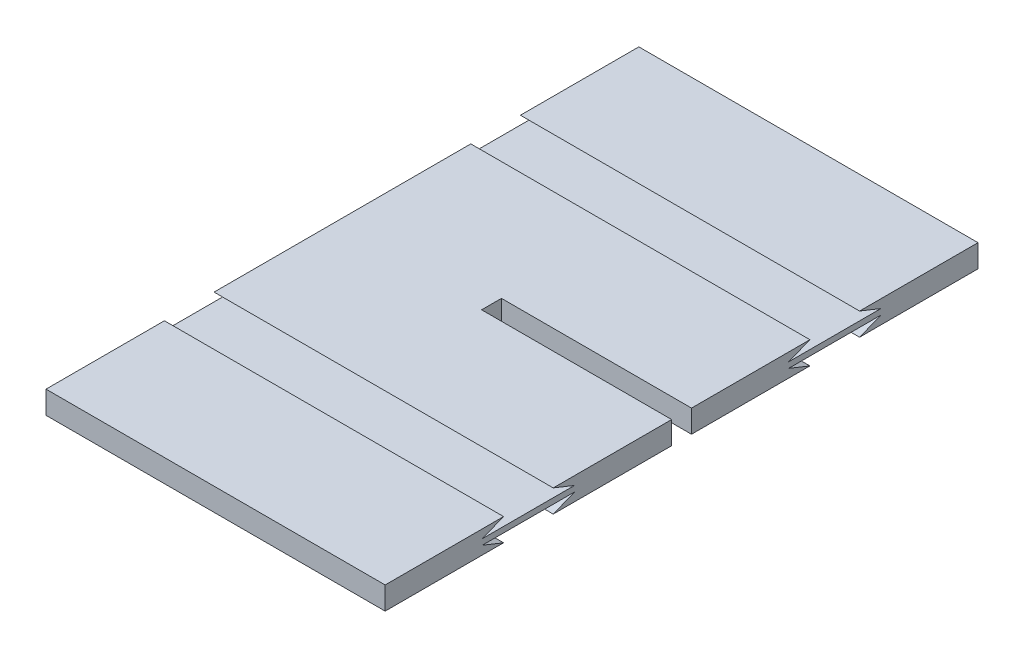
ISO-10303-21;
HEADER;
FILE_DESCRIPTION(('STEP AP214'),'2;1');
FILE_NAME('part.step','',(''),(''),'','','');
FILE_SCHEMA(('AUTOMOTIVE_DESIGN { 1 0 10303 214 1 1 1 1 }'));
ENDSEC;
DATA;
#1=APPLICATION_CONTEXT('core data for automotive mechanical design processes');
#2=APPLICATION_PROTOCOL_DEFINITION('international standard','automotive_design',2000,#1);
#3=PRODUCT_CONTEXT('',#1,'mechanical');
#4=PRODUCT('Part','Part','',(#3));
#5=PRODUCT_RELATED_PRODUCT_CATEGORY('part','',(#4));
#6=PRODUCT_DEFINITION_FORMATION('','',#4);
#7=PRODUCT_DEFINITION_CONTEXT('part definition',#1,'design');
#8=PRODUCT_DEFINITION('design','',#6,#7);
#9=PRODUCT_DEFINITION_SHAPE('','',#8);
#10=(LENGTH_UNIT() NAMED_UNIT(*) SI_UNIT(.MILLI.,.METRE.));
#11=(NAMED_UNIT(*) PLANE_ANGLE_UNIT() SI_UNIT($,.RADIAN.));
#12=(NAMED_UNIT(*) SI_UNIT($,.STERADIAN.) SOLID_ANGLE_UNIT());
#13=UNCERTAINTY_MEASURE_WITH_UNIT(LENGTH_MEASURE(1.E-05),#10,'distance_accuracy_value','');
#14=(GEOMETRIC_REPRESENTATION_CONTEXT(3) GLOBAL_UNCERTAINTY_ASSIGNED_CONTEXT((#13)) GLOBAL_UNIT_ASSIGNED_CONTEXT((#10,
#11,#12)) REPRESENTATION_CONTEXT('',''));
#15=CARTESIAN_POINT('',(0.,0.,0.));
#16=DIRECTION('',(0.,0.,1.));
#17=DIRECTION('',(1.,0.,0.));
#18=AXIS2_PLACEMENT_3D('',#15,#16,#17);
#19=CARTESIAN_POINT('',(0.,0.8,0.));
#20=DIRECTION('',(0.,1.,0.));
#21=DIRECTION('',(0.,0.,1.));
#22=AXIS2_PLACEMENT_3D('',#19,#20,#21);
#23=PLANE('',#22);
#24=DIRECTION('',(0.,0.,1.));
#25=VECTOR('',#24,1.);
#26=CARTESIAN_POINT('',(-1.52175925925925,0.8,10.45));
#27=LINE('',#26,#25);
#28=CARTESIAN_POINT('',(-1.52175925925925,0.8,-10.45));
#29=VERTEX_POINT('',#28);
#30=CARTESIAN_POINT('',(-1.52175925925925,0.8,-6.27500000000001));
#31=VERTEX_POINT('',#30);
#32=EDGE_CURVE('E57',#29,#31,#27,.T.);
#33=ORIENTED_EDGE('',*,*,#32,.F.);
#34=DIRECTION('',(1.,0.,0.));
#35=VECTOR('',#34,1.);
#36=CARTESIAN_POINT('',(0.,0.8,-10.45));
#37=LINE('',#36,#35);
#38=CARTESIAN_POINT('',(-13.4782407407407,0.8,-10.45));
#39=VERTEX_POINT('',#38);
#40=EDGE_CURVE('E211',#39,#29,#37,.T.);
#41=ORIENTED_EDGE('',*,*,#40,.F.);
#42=DIRECTION('',(0.,0.,-1.));
#43=VECTOR('',#42,1.);
#44=CARTESIAN_POINT('',(-13.4782407407407,0.8,0.));
#45=LINE('',#44,#43);
#46=CARTESIAN_POINT('',(-13.4782407407407,0.800000000000006,-6.275));
#47=VERTEX_POINT('',#46);
#48=EDGE_CURVE('E309',#47,#39,#45,.T.);
#49=ORIENTED_EDGE('',*,*,#48,.F.);
#50=DIRECTION('',(-1.,0.,0.));
#51=VECTOR('',#50,1.);
#52=CARTESIAN_POINT('',(0.,0.8,-6.27500000000001));
#53=LINE('',#52,#51);
#54=EDGE_CURVE('E258',#31,#47,#53,.T.);
#55=ORIENTED_EDGE('',*,*,#54,.F.);
#56=EDGE_LOOP('',(#33,#41,#49,#55));
#57=FACE_BOUND('',#56,.T.);
#58=ADVANCED_FACE('F34',(#57),#23,.T.);
#59=CARTESIAN_POINT('',(-1.52175925925925,0.8,-4.525));
#60=VERTEX_POINT('',#59);
#61=CARTESIAN_POINT('',(-1.52175925925925,0.8,-0.35));
#62=VERTEX_POINT('',#61);
#63=EDGE_CURVE('E433',#60,#62,#27,.T.);
#64=ORIENTED_EDGE('',*,*,#63,.F.);
#65=DIRECTION('',(1.,0.,0.));
#66=VECTOR('',#65,1.);
#67=CARTESIAN_POINT('',(0.,0.8,-4.525));
#68=LINE('',#67,#66);
#69=CARTESIAN_POINT('',(-13.4782407407407,0.8,-4.525));
#70=VERTEX_POINT('',#69);
#71=EDGE_CURVE('E260',#70,#60,#68,.T.);
#72=ORIENTED_EDGE('',*,*,#71,.F.);
#73=CARTESIAN_POINT('',(-13.4782407407407,0.8,4.525));
#74=VERTEX_POINT('',#73);
#75=EDGE_CURVE('E293',#74,#70,#45,.T.);
#76=ORIENTED_EDGE('',*,*,#75,.F.);
#77=DIRECTION('',(-1.,0.,0.));
#78=VECTOR('',#77,1.);
#79=CARTESIAN_POINT('',(0.,0.8,4.525));
#80=LINE('',#79,#78);
#81=CARTESIAN_POINT('',(-1.52175925925925,0.8,4.525));
#82=VERTEX_POINT('',#81);
#83=EDGE_CURVE('E253',#82,#74,#80,.T.);
#84=ORIENTED_EDGE('',*,*,#83,.F.);
#85=CARTESIAN_POINT('',(-1.52175925925925,0.8,0.35));
#86=VERTEX_POINT('',#85);
#87=EDGE_CURVE('E434',#86,#82,#27,.T.);
#88=ORIENTED_EDGE('',*,*,#87,.F.);
#89=DIRECTION('',(-1.,0.,0.));
#90=VECTOR('',#89,1.);
#91=CARTESIAN_POINT('',(0.,0.8,0.349999999999999));
#92=LINE('',#91,#90);
#93=CARTESIAN_POINT('',(-8.22175925925925,0.8,0.35));
#94=VERTEX_POINT('',#93);
#95=EDGE_CURVE('E231',#86,#94,#92,.T.);
#96=ORIENTED_EDGE('',*,*,#95,.T.);
#97=DIRECTION('',(0.,0.,-1.));
#98=VECTOR('',#97,1.);
#99=CARTESIAN_POINT('',(-8.22175925925925,0.8,0.));
#100=LINE('',#99,#98);
#101=CARTESIAN_POINT('',(-8.22175925925925,0.8,-0.35));
#102=VERTEX_POINT('',#101);
#103=EDGE_CURVE('E303',#94,#102,#100,.T.);
#104=ORIENTED_EDGE('',*,*,#103,.T.);
#105=DIRECTION('',(-1.,0.,0.));
#106=VECTOR('',#105,1.);
#107=CARTESIAN_POINT('',(0.,0.8,-0.349999999999999));
#108=LINE('',#107,#106);
#109=EDGE_CURVE('E306',#62,#102,#108,.T.);
#110=ORIENTED_EDGE('',*,*,#109,.F.);
#111=EDGE_LOOP('',(#64,#72,#76,#84,#88,#96,#104,#110));
#112=FACE_BOUND('',#111,.T.);
#113=ADVANCED_FACE('F334',(#112),#23,.T.);
#114=CARTESIAN_POINT('',(0.,0.,0.));
#115=DIRECTION('',(0.,1.,0.));
#116=DIRECTION('',(0.,0.,1.));
#117=AXIS2_PLACEMENT_3D('',#114,#115,#116);
#118=PLANE('',#117);
#119=DIRECTION('',(1.,0.,0.));
#120=VECTOR('',#119,1.);
#121=CARTESIAN_POINT('',(0.,0.,-10.45));
#122=LINE('',#121,#120);
#123=CARTESIAN_POINT('',(-13.4782407407407,0.,-10.45));
#124=VERTEX_POINT('',#123);
#125=CARTESIAN_POINT('',(-1.52175925925925,0.,-10.45));
#126=VERTEX_POINT('',#125);
#127=EDGE_CURVE('E209',#124,#126,#122,.T.);
#128=ORIENTED_EDGE('',*,*,#127,.T.);
#129=DIRECTION('',(0.,0.,1.));
#130=VECTOR('',#129,1.);
#131=CARTESIAN_POINT('',(-1.52175925925925,0.,10.45));
#132=LINE('',#131,#130);
#133=CARTESIAN_POINT('',(-1.52175925925925,0.,-6.275));
#134=VERTEX_POINT('',#133);
#135=EDGE_CURVE('E192',#126,#134,#132,.T.);
#136=ORIENTED_EDGE('',*,*,#135,.T.);
#137=DIRECTION('',(-1.,0.,0.));
#138=VECTOR('',#137,1.);
#139=CARTESIAN_POINT('',(0.,0.,-6.27500000000001));
#140=LINE('',#139,#138);
#141=CARTESIAN_POINT('',(-13.4782407407407,0.,-6.275));
#142=VERTEX_POINT('',#141);
#143=EDGE_CURVE('E251',#134,#142,#140,.T.);
#144=ORIENTED_EDGE('',*,*,#143,.T.);
#145=DIRECTION('',(0.,0.,-1.));
#146=VECTOR('',#145,1.);
#147=CARTESIAN_POINT('',(-13.4782407407407,0.,0.));
#148=LINE('',#147,#146);
#149=EDGE_CURVE('E216',#142,#124,#148,.T.);
#150=ORIENTED_EDGE('',*,*,#149,.T.);
#151=EDGE_LOOP('',(#128,#136,#144,#150));
#152=FACE_BOUND('',#151,.T.);
#153=ADVANCED_FACE('F214',(#152),#118,.F.);
#154=DIRECTION('',(1.,0.,0.));
#155=VECTOR('',#154,1.);
#156=CARTESIAN_POINT('',(0.,0.,-4.525));
#157=LINE('',#156,#155);
#158=CARTESIAN_POINT('',(-13.4782407407407,0.,-4.525));
#159=VERTEX_POINT('',#158);
#160=CARTESIAN_POINT('',(-1.52175925925925,0.,-4.52500000000002));
#161=VERTEX_POINT('',#160);
#162=EDGE_CURVE('E248',#159,#161,#157,.T.);
#163=ORIENTED_EDGE('',*,*,#162,.T.);
#164=CARTESIAN_POINT('',(-1.52175925925925,0.,-0.35));
#165=VERTEX_POINT('',#164);
#166=EDGE_CURVE('E201',#161,#165,#132,.T.);
#167=ORIENTED_EDGE('',*,*,#166,.T.);
#168=DIRECTION('',(-1.,0.,0.));
#169=VECTOR('',#168,1.);
#170=CARTESIAN_POINT('',(0.,0.,-0.349999999999999));
#171=LINE('',#170,#169);
#172=CARTESIAN_POINT('',(-8.22175925925925,0.,-0.35));
#173=VERTEX_POINT('',#172);
#174=EDGE_CURVE('E218',#165,#173,#171,.T.);
#175=ORIENTED_EDGE('',*,*,#174,.T.);
#176=DIRECTION('',(0.,0.,-1.));
#177=VECTOR('',#176,1.);
#178=CARTESIAN_POINT('',(-8.22175925925925,0.,0.));
#179=LINE('',#178,#177);
#180=CARTESIAN_POINT('',(-8.22175925925925,0.,0.35));
#181=VERTEX_POINT('',#180);
#182=EDGE_CURVE('E223',#181,#173,#179,.T.);
#183=ORIENTED_EDGE('',*,*,#182,.F.);
#184=DIRECTION('',(-1.,0.,0.));
#185=VECTOR('',#184,1.);
#186=CARTESIAN_POINT('',(0.,0.,0.349999999999999));
#187=LINE('',#186,#185);
#188=CARTESIAN_POINT('',(-1.52175925925925,0.,0.35));
#189=VERTEX_POINT('',#188);
#190=EDGE_CURVE('E294',#189,#181,#187,.T.);
#191=ORIENTED_EDGE('',*,*,#190,.F.);
#192=CARTESIAN_POINT('',(-1.52175925925925,0.,4.52500000000002));
#193=VERTEX_POINT('',#192);
#194=EDGE_CURVE('E431',#189,#193,#132,.T.);
#195=ORIENTED_EDGE('',*,*,#194,.T.);
#196=DIRECTION('',(-1.,0.,0.));
#197=VECTOR('',#196,1.);
#198=CARTESIAN_POINT('',(0.,0.,4.525));
#199=LINE('',#198,#197);
#200=CARTESIAN_POINT('',(-13.4782407407407,0.,4.525));
#201=VERTEX_POINT('',#200);
#202=EDGE_CURVE('E246',#193,#201,#199,.T.);
#203=ORIENTED_EDGE('',*,*,#202,.T.);
#204=EDGE_CURVE('E220',#201,#159,#148,.T.);
#205=ORIENTED_EDGE('',*,*,#204,.T.);
#206=EDGE_LOOP('',(#163,#167,#175,#183,#191,#195,#203,#205));
#207=FACE_BOUND('',#206,.T.);
#208=ADVANCED_FACE('F323',(#207),#118,.F.);
#209=CARTESIAN_POINT('',(0.,0.8,0.349999999999999));
#210=DIRECTION('',(0.,0.,1.));
#211=DIRECTION('',(1.,0.,0.));
#212=AXIS2_PLACEMENT_3D('',#209,#210,#211);
#213=PLANE('',#212);
#214=ORIENTED_EDGE('',*,*,#95,.F.);
#215=DIRECTION('',(0.,-1.,0.));
#216=VECTOR('',#215,1.);
#217=CARTESIAN_POINT('',(-1.52175925925925,0.8,0.349999999999999));
#218=LINE('',#217,#216);
#219=EDGE_CURVE('E339',#86,#189,#218,.T.);
#220=ORIENTED_EDGE('',*,*,#219,.T.);
#221=ORIENTED_EDGE('',*,*,#190,.T.);
#222=DIRECTION('',(0.,-1.,0.));
#223=VECTOR('',#222,1.);
#224=CARTESIAN_POINT('',(-8.22175925925925,0.8,0.35));
#225=LINE('',#224,#223);
#226=EDGE_CURVE('E240',#94,#181,#225,.T.);
#227=ORIENTED_EDGE('',*,*,#226,.F.);
#228=EDGE_LOOP('',(#214,#220,#221,#227));
#229=FACE_BOUND('',#228,.T.);
#230=ADVANCED_FACE('F36',(#229),#213,.F.);
#231=CARTESIAN_POINT('',(-8.22175925925925,0.8,0.));
#232=DIRECTION('',(-1.,0.,0.));
#233=DIRECTION('',(0.,0.,1.));
#234=AXIS2_PLACEMENT_3D('',#231,#232,#233);
#235=PLANE('',#234);
#236=ORIENTED_EDGE('',*,*,#182,.T.);
#237=DIRECTION('',(0.,-1.,0.));
#238=VECTOR('',#237,1.);
#239=CARTESIAN_POINT('',(-8.22175925925925,0.8,-0.35));
#240=LINE('',#239,#238);
#241=EDGE_CURVE('E237',#102,#173,#240,.T.);
#242=ORIENTED_EDGE('',*,*,#241,.F.);
#243=ORIENTED_EDGE('',*,*,#103,.F.);
#244=ORIENTED_EDGE('',*,*,#226,.T.);
#245=EDGE_LOOP('',(#236,#242,#243,#244));
#246=FACE_BOUND('',#245,.T.);
#247=ADVANCED_FACE('F318',(#246),#235,.F.);
#248=CARTESIAN_POINT('',(0.,0.8,-0.349999999999999));
#249=DIRECTION('',(0.,0.,1.));
#250=DIRECTION('',(1.,0.,0.));
#251=AXIS2_PLACEMENT_3D('',#248,#249,#250);
#252=PLANE('',#251);
#253=DIRECTION('',(0.,-1.,0.));
#254=VECTOR('',#253,1.);
#255=CARTESIAN_POINT('',(-1.52175925925925,0.8,-0.349999999999999));
#256=LINE('',#255,#254);
#257=EDGE_CURVE('E331',#62,#165,#256,.T.);
#258=ORIENTED_EDGE('',*,*,#257,.F.);
#259=ORIENTED_EDGE('',*,*,#109,.T.);
#260=ORIENTED_EDGE('',*,*,#241,.T.);
#261=ORIENTED_EDGE('',*,*,#174,.F.);
#262=EDGE_LOOP('',(#258,#259,#260,#261));
#263=FACE_BOUND('',#262,.T.);
#264=ADVANCED_FACE('F329',(#263),#252,.T.);
#265=CARTESIAN_POINT('',(0.,0.8,-10.45));
#266=DIRECTION('',(0.,0.,-1.));
#267=DIRECTION('',(-1.,0.,0.));
#268=AXIS2_PLACEMENT_3D('',#265,#266,#267);
#269=PLANE('',#268);
#270=DIRECTION('',(0.,1.,0.));
#271=VECTOR('',#270,1.);
#272=CARTESIAN_POINT('',(-1.52175925925925,0.,-10.45));
#273=LINE('',#272,#271);
#274=EDGE_CURVE('E195',#126,#29,#273,.T.);
#275=ORIENTED_EDGE('',*,*,#274,.F.);
#276=ORIENTED_EDGE('',*,*,#127,.F.);
#277=DIRECTION('',(0.,-1.,0.));
#278=VECTOR('',#277,1.);
#279=CARTESIAN_POINT('',(-13.4782407407407,0.8,-10.45));
#280=LINE('',#279,#278);
#281=EDGE_CURVE('E234',#39,#124,#280,.T.);
#282=ORIENTED_EDGE('',*,*,#281,.F.);
#283=ORIENTED_EDGE('',*,*,#40,.T.);
#284=EDGE_LOOP('',(#275,#276,#282,#283));
#285=FACE_BOUND('',#284,.T.);
#286=ADVANCED_FACE('F207',(#285),#269,.T.);
#287=CARTESIAN_POINT('',(-13.4782407407407,0.8,0.));
#288=DIRECTION('',(-1.,0.,0.));
#289=DIRECTION('',(0.,0.,1.));
#290=AXIS2_PLACEMENT_3D('',#287,#288,#289);
#291=PLANE('',#290);
#292=DIRECTION('',(0.,0.371390676354107,-0.928476690885258));
#293=VECTOR('',#292,1.);
#294=CARTESIAN_POINT('',(-13.4782407407407,-0.760344827586219,-0.624137931034494));
#295=LINE('',#294,#293);
#296=CARTESIAN_POINT('',(-13.4782407407407,0.5,-3.77500000000001));
#297=VERTEX_POINT('',#296);
#298=EDGE_CURVE('E284',#297,#70,#295,.T.);
#299=ORIENTED_EDGE('',*,*,#298,.F.);
#300=DIRECTION('',(0.,0.,1.));
#301=VECTOR('',#300,1.);
#302=CARTESIAN_POINT('',(-13.4782407407407,0.500000000000001,0.));
#303=LINE('',#302,#301);
#304=CARTESIAN_POINT('',(-13.4782407407407,0.5,-7.02499999999999));
#305=VERTEX_POINT('',#304);
#306=EDGE_CURVE('E42',#305,#297,#303,.T.);
#307=ORIENTED_EDGE('',*,*,#306,.F.);
#308=DIRECTION('',(0.,-0.371390676354114,-0.928476690885255));
#309=VECTOR('',#308,1.);
#310=CARTESIAN_POINT('',(-13.4782407407407,2.96379310344833,-0.865517241379358));
#311=LINE('',#310,#309);
#312=EDGE_CURVE('E295',#47,#305,#311,.T.);
#313=ORIENTED_EDGE('',*,*,#312,.F.);
#314=ORIENTED_EDGE('',*,*,#48,.T.);
#315=ORIENTED_EDGE('',*,*,#281,.T.);
#316=ORIENTED_EDGE('',*,*,#149,.F.);
#317=DIRECTION('',(0.,-0.371390676354114,0.928476690885255));
#318=VECTOR('',#317,1.);
#319=CARTESIAN_POINT('',(-13.4782407407407,-2.05344827586212,-1.14137931034488));
#320=LINE('',#319,#318);
#321=CARTESIAN_POINT('',(-13.4782407407407,0.3,-7.02499999999999));
#322=VERTEX_POINT('',#321);
#323=EDGE_CURVE('E370',#322,#142,#320,.T.);
#324=ORIENTED_EDGE('',*,*,#323,.F.);
#325=DIRECTION('',(0.,0.,-1.));
#326=VECTOR('',#325,1.);
#327=CARTESIAN_POINT('',(-13.4782407407407,0.299999999999999,0.));
#328=LINE('',#327,#326);
#329=CARTESIAN_POINT('',(-13.4782407407407,0.3,-3.77500000000001));
#330=VERTEX_POINT('',#329);
#331=EDGE_CURVE('E267',#330,#322,#328,.T.);
#332=ORIENTED_EDGE('',*,*,#331,.F.);
#333=DIRECTION('',(0.,0.371390676354107,0.928476690885258));
#334=VECTOR('',#333,1.);
#335=CARTESIAN_POINT('',(-13.4782407407407,1.67068965517243,-0.348275862068975));
#336=LINE('',#335,#334);
#337=EDGE_CURVE('E368',#159,#330,#336,.T.);
#338=ORIENTED_EDGE('',*,*,#337,.F.);
#339=ORIENTED_EDGE('',*,*,#204,.F.);
#340=DIRECTION('',(0.,-0.371390676354107,0.928476690885258));
#341=VECTOR('',#340,1.);
#342=CARTESIAN_POINT('',(-13.4782407407407,1.67068965517243,0.348275862068975));
#343=LINE('',#342,#341);
#344=CARTESIAN_POINT('',(-13.4782407407407,0.3,3.77500000000001));
#345=VERTEX_POINT('',#344);
#346=EDGE_CURVE('E365',#345,#201,#343,.T.);
#347=ORIENTED_EDGE('',*,*,#346,.F.);
#348=DIRECTION('',(0.,0.,-1.));
#349=VECTOR('',#348,1.);
#350=CARTESIAN_POINT('',(-13.4782407407407,0.299999999999999,0.));
#351=LINE('',#350,#349);
#352=CARTESIAN_POINT('',(-13.4782407407407,0.3,7.02499999999999));
#353=VERTEX_POINT('',#352);
#354=EDGE_CURVE('E265',#353,#345,#351,.T.);
#355=ORIENTED_EDGE('',*,*,#354,.F.);
#356=DIRECTION('',(0.,0.371390676354114,0.928476690885255));
#357=VECTOR('',#356,1.);
#358=CARTESIAN_POINT('',(-13.4782407407407,-2.05344827586212,1.14137931034488));
#359=LINE('',#358,#357);
#360=CARTESIAN_POINT('',(-13.4782407407407,0.,6.275));
#361=VERTEX_POINT('',#360);
#362=EDGE_CURVE('E361',#361,#353,#359,.T.);
#363=ORIENTED_EDGE('',*,*,#362,.F.);
#364=CARTESIAN_POINT('',(-13.4782407407407,0.,10.45));
#365=VERTEX_POINT('',#364);
#366=EDGE_CURVE('E222',#365,#361,#148,.T.);
#367=ORIENTED_EDGE('',*,*,#366,.F.);
#368=DIRECTION('',(0.,-1.,0.));
#369=VECTOR('',#368,1.);
#370=CARTESIAN_POINT('',(-13.4782407407407,0.8,10.45));
#371=LINE('',#370,#369);
#372=CARTESIAN_POINT('',(-13.4782407407407,0.8,10.45));
#373=VERTEX_POINT('',#372);
#374=EDGE_CURVE('E232',#373,#365,#371,.T.);
#375=ORIENTED_EDGE('',*,*,#374,.F.);
#376=CARTESIAN_POINT('',(-13.4782407407407,0.800000000000006,6.275));
#377=VERTEX_POINT('',#376);
#378=EDGE_CURVE('E310',#373,#377,#45,.T.);
#379=ORIENTED_EDGE('',*,*,#378,.T.);
#380=DIRECTION('',(0.,0.371390676354114,-0.928476690885255));
#381=VECTOR('',#380,1.);
#382=CARTESIAN_POINT('',(-13.4782407407407,2.96379310344833,0.865517241379358));
#383=LINE('',#382,#381);
#384=CARTESIAN_POINT('',(-13.4782407407407,0.5,7.02499999999999));
#385=VERTEX_POINT('',#384);
#386=EDGE_CURVE('E298',#385,#377,#383,.T.);
#387=ORIENTED_EDGE('',*,*,#386,.F.);
#388=DIRECTION('',(0.,0.,1.));
#389=VECTOR('',#388,1.);
#390=CARTESIAN_POINT('',(-13.4782407407407,0.500000000000001,0.));
#391=LINE('',#390,#389);
#392=CARTESIAN_POINT('',(-13.4782407407407,0.5,3.77500000000001));
#393=VERTEX_POINT('',#392);
#394=EDGE_CURVE('E263',#393,#385,#391,.T.);
#395=ORIENTED_EDGE('',*,*,#394,.F.);
#396=DIRECTION('',(0.,-0.371390676354107,-0.928476690885258));
#397=VECTOR('',#396,1.);
#398=CARTESIAN_POINT('',(-13.4782407407407,-0.760344827586219,0.624137931034494));
#399=LINE('',#398,#397);
#400=EDGE_CURVE('E373',#74,#393,#399,.T.);
#401=ORIENTED_EDGE('',*,*,#400,.F.);
#402=ORIENTED_EDGE('',*,*,#75,.T.);
#403=EDGE_LOOP('',(#299,#307,#313,#314,#315,#316,#324,#332,#338,#339,#347,#355,#363,#367,#375,
#379,#387,#395,#401,#402));
#404=FACE_BOUND('',#403,.T.);
#405=ADVANCED_FACE('F290',(#404),#291,.T.);
#406=CARTESIAN_POINT('',(0.,0.8,10.45));
#407=DIRECTION('',(0.,0.,-1.));
#408=DIRECTION('',(-1.,0.,0.));
#409=AXIS2_PLACEMENT_3D('',#406,#407,#408);
#410=PLANE('',#409);
#411=DIRECTION('',(1.,0.,0.));
#412=VECTOR('',#411,1.);
#413=CARTESIAN_POINT('',(0.,0.,10.45));
#414=LINE('',#413,#412);
#415=CARTESIAN_POINT('',(-1.52175925925925,0.,10.45));
#416=VERTEX_POINT('',#415);
#417=EDGE_CURVE('E228',#365,#416,#414,.T.);
#418=ORIENTED_EDGE('',*,*,#417,.T.);
#419=DIRECTION('',(0.,1.,0.));
#420=VECTOR('',#419,1.);
#421=CARTESIAN_POINT('',(-1.52175925925925,0.,10.45));
#422=LINE('',#421,#420);
#423=CARTESIAN_POINT('',(-1.52175925925925,0.8,10.45));
#424=VERTEX_POINT('',#423);
#425=EDGE_CURVE('E212',#416,#424,#422,.T.);
#426=ORIENTED_EDGE('',*,*,#425,.T.);
#427=DIRECTION('',(1.,0.,0.));
#428=VECTOR('',#427,1.);
#429=CARTESIAN_POINT('',(0.,0.8,10.45));
#430=LINE('',#429,#428);
#431=EDGE_CURVE('E235',#373,#424,#430,.T.);
#432=ORIENTED_EDGE('',*,*,#431,.F.);
#433=ORIENTED_EDGE('',*,*,#374,.T.);
#434=EDGE_LOOP('',(#418,#426,#432,#433));
#435=FACE_BOUND('',#434,.T.);
#436=ADVANCED_FACE('F392',(#435),#410,.F.);
#437=CARTESIAN_POINT('',(-1.52175925925925,0.8,6.27500000000001));
#438=VERTEX_POINT('',#437);
#439=EDGE_CURVE('E385',#438,#424,#27,.T.);
#440=ORIENTED_EDGE('',*,*,#439,.F.);
#441=DIRECTION('',(1.,0.,0.));
#442=VECTOR('',#441,1.);
#443=CARTESIAN_POINT('',(0.,0.8,6.27500000000001));
#444=LINE('',#443,#442);
#445=EDGE_CURVE('E255',#377,#438,#444,.T.);
#446=ORIENTED_EDGE('',*,*,#445,.F.);
#447=ORIENTED_EDGE('',*,*,#378,.F.);
#448=ORIENTED_EDGE('',*,*,#431,.T.);
#449=EDGE_LOOP('',(#440,#446,#447,#448));
#450=FACE_BOUND('',#449,.T.);
#451=ADVANCED_FACE('F384',(#450),#23,.T.);
#452=DIRECTION('',(1.,0.,0.));
#453=VECTOR('',#452,1.);
#454=CARTESIAN_POINT('',(0.,0.,6.27500000000002));
#455=LINE('',#454,#453);
#456=CARTESIAN_POINT('',(-1.52175925925925,0.,6.275));
#457=VERTEX_POINT('',#456);
#458=EDGE_CURVE('E243',#361,#457,#455,.T.);
#459=ORIENTED_EDGE('',*,*,#458,.T.);
#460=EDGE_CURVE('E203',#457,#416,#132,.T.);
#461=ORIENTED_EDGE('',*,*,#460,.T.);
#462=ORIENTED_EDGE('',*,*,#417,.F.);
#463=ORIENTED_EDGE('',*,*,#366,.T.);
#464=EDGE_LOOP('',(#459,#461,#462,#463));
#465=FACE_BOUND('',#464,.T.);
#466=ADVANCED_FACE('F474',(#465),#118,.F.);
#467=CARTESIAN_POINT('',(-13.5217592592593,0.3,7.02499999999999));
#468=DIRECTION('',(0.,1.,0.));
#469=DIRECTION('',(0.,0.,1.));
#470=AXIS2_PLACEMENT_3D('',#467,#468,#469);
#471=PLANE('',#470);
#472=DIRECTION('',(1.,0.,0.));
#473=VECTOR('',#472,1.);
#474=CARTESIAN_POINT('',(-13.5217592592593,0.3,3.77500000000001));
#475=LINE('',#474,#473);
#476=CARTESIAN_POINT('',(-1.52175925925925,0.3,3.77500000000001));
#477=VERTEX_POINT('',#476);
#478=EDGE_CURVE('E346',#345,#477,#475,.T.);
#479=ORIENTED_EDGE('',*,*,#478,.T.);
#480=DIRECTION('',(0.,0.,1.));
#481=VECTOR('',#480,1.);
#482=CARTESIAN_POINT('',(-1.52175925925925,0.3,7.02499999999999));
#483=LINE('',#482,#481);
#484=CARTESIAN_POINT('',(-1.52175925925925,0.3,7.02499999999999));
#485=VERTEX_POINT('',#484);
#486=EDGE_CURVE('E415',#477,#485,#483,.T.);
#487=ORIENTED_EDGE('',*,*,#486,.T.);
#488=DIRECTION('',(1.,0.,0.));
#489=VECTOR('',#488,1.);
#490=CARTESIAN_POINT('',(-13.5217592592593,0.3,7.02499999999999));
#491=LINE('',#490,#489);
#492=EDGE_CURVE('E350',#353,#485,#491,.T.);
#493=ORIENTED_EDGE('',*,*,#492,.F.);
#494=ORIENTED_EDGE('',*,*,#354,.T.);
#495=EDGE_LOOP('',(#479,#487,#493,#494));
#496=FACE_BOUND('',#495,.T.);
#497=ADVANCED_FACE('F424',(#496),#471,.F.);
#498=CARTESIAN_POINT('',(-13.5217592592593,0.3,3.77500000000001));
#499=DIRECTION('',(0.,-0.928476690885258,-0.371390676354107));
#500=DIRECTION('',(0.,0.371390676354107,-0.928476690885258));
#501=AXIS2_PLACEMENT_3D('',#498,#499,#500);
#502=PLANE('',#501);
#503=ORIENTED_EDGE('',*,*,#202,.F.);
#504=DIRECTION('',(0.,0.371390676354107,-0.928476690885258));
#505=VECTOR('',#504,1.);
#506=CARTESIAN_POINT('',(-1.52175925925925,0.3,3.77500000000001));
#507=LINE('',#506,#505);
#508=EDGE_CURVE('E342',#193,#477,#507,.T.);
#509=ORIENTED_EDGE('',*,*,#508,.T.);
#510=ORIENTED_EDGE('',*,*,#478,.F.);
#511=ORIENTED_EDGE('',*,*,#346,.T.);
#512=EDGE_LOOP('',(#503,#509,#510,#511));
#513=FACE_BOUND('',#512,.T.);
#514=ADVANCED_FACE('F421',(#513),#502,.F.);
#515=CARTESIAN_POINT('',(-13.5217592592593,0.3,7.02499999999999));
#516=DIRECTION('',(0.,-0.928476690885255,0.371390676354114));
#517=DIRECTION('',(0.,-0.371390676354114,-0.928476690885255));
#518=AXIS2_PLACEMENT_3D('',#515,#516,#517);
#519=PLANE('',#518);
#520=ORIENTED_EDGE('',*,*,#492,.T.);
#521=DIRECTION('',(0.,-0.371390676354114,-0.928476690885255));
#522=VECTOR('',#521,1.);
#523=CARTESIAN_POINT('',(-1.52175925925925,0.3,7.02499999999999));
#524=LINE('',#523,#522);
#525=EDGE_CURVE('E412',#485,#457,#524,.T.);
#526=ORIENTED_EDGE('',*,*,#525,.T.);
#527=ORIENTED_EDGE('',*,*,#458,.F.);
#528=ORIENTED_EDGE('',*,*,#362,.T.);
#529=EDGE_LOOP('',(#520,#526,#527,#528));
#530=FACE_BOUND('',#529,.T.);
#531=ADVANCED_FACE('F455',(#530),#519,.F.);
#532=CARTESIAN_POINT('',(-13.5217592592593,0.3,-7.02499999999999));
#533=DIRECTION('',(0.,-0.928476690885255,-0.371390676354114));
#534=DIRECTION('',(0.,0.371390676354114,-0.928476690885255));
#535=AXIS2_PLACEMENT_3D('',#532,#533,#534);
#536=PLANE('',#535);
#537=ORIENTED_EDGE('',*,*,#143,.F.);
#538=DIRECTION('',(0.,0.371390676354114,-0.928476690885255));
#539=VECTOR('',#538,1.);
#540=CARTESIAN_POINT('',(-1.52175925925925,0.3,-7.02499999999999));
#541=LINE('',#540,#539);
#542=CARTESIAN_POINT('',(-1.52175925925925,0.3,-7.02499999999999));
#543=VERTEX_POINT('',#542);
#544=EDGE_CURVE('E197',#134,#543,#541,.T.);
#545=ORIENTED_EDGE('',*,*,#544,.T.);
#546=DIRECTION('',(1.,0.,0.));
#547=VECTOR('',#546,1.);
#548=CARTESIAN_POINT('',(-13.5217592592593,0.3,-7.02499999999999));
#549=LINE('',#548,#547);
#550=EDGE_CURVE('E287',#322,#543,#549,.T.);
#551=ORIENTED_EDGE('',*,*,#550,.F.);
#552=ORIENTED_EDGE('',*,*,#323,.T.);
#553=EDGE_LOOP('',(#537,#545,#551,#552));
#554=FACE_BOUND('',#553,.T.);
#555=ADVANCED_FACE('F453',(#554),#536,.F.);
#556=CARTESIAN_POINT('',(-13.5217592592593,0.3,-3.77500000000001));
#557=DIRECTION('',(0.,-0.928476690885258,0.371390676354107));
#558=DIRECTION('',(0.,-0.371390676354107,-0.928476690885258));
#559=AXIS2_PLACEMENT_3D('',#556,#557,#558);
#560=PLANE('',#559);
#561=DIRECTION('',(1.,0.,0.));
#562=VECTOR('',#561,1.);
#563=CARTESIAN_POINT('',(-13.5217592592593,0.3,-3.77500000000001));
#564=LINE('',#563,#562);
#565=CARTESIAN_POINT('',(-1.52175925925925,0.3,-3.77500000000001));
#566=VERTEX_POINT('',#565);
#567=EDGE_CURVE('E353',#330,#566,#564,.T.);
#568=ORIENTED_EDGE('',*,*,#567,.T.);
#569=DIRECTION('',(0.,-0.371390676354107,-0.928476690885258));
#570=VECTOR('',#569,1.);
#571=CARTESIAN_POINT('',(-1.52175925925925,0.3,-3.77500000000001));
#572=LINE('',#571,#570);
#573=EDGE_CURVE('E408',#566,#161,#572,.T.);
#574=ORIENTED_EDGE('',*,*,#573,.T.);
#575=ORIENTED_EDGE('',*,*,#162,.F.);
#576=ORIENTED_EDGE('',*,*,#337,.T.);
#577=EDGE_LOOP('',(#568,#574,#575,#576));
#578=FACE_BOUND('',#577,.T.);
#579=ADVANCED_FACE('F446',(#578),#560,.F.);
#580=CARTESIAN_POINT('',(-13.5217592592593,0.3,-7.02499999999999));
#581=DIRECTION('',(0.,1.,0.));
#582=DIRECTION('',(0.,0.,1.));
#583=AXIS2_PLACEMENT_3D('',#580,#581,#582);
#584=PLANE('',#583);
#585=ORIENTED_EDGE('',*,*,#550,.T.);
#586=DIRECTION('',(0.,0.,1.));
#587=VECTOR('',#586,1.);
#588=CARTESIAN_POINT('',(-1.52175925925925,0.3,-7.02499999999999));
#589=LINE('',#588,#587);
#590=EDGE_CURVE('E405',#543,#566,#589,.T.);
#591=ORIENTED_EDGE('',*,*,#590,.T.);
#592=ORIENTED_EDGE('',*,*,#567,.F.);
#593=ORIENTED_EDGE('',*,*,#331,.T.);
#594=EDGE_LOOP('',(#585,#591,#592,#593));
#595=FACE_BOUND('',#594,.T.);
#596=ADVANCED_FACE('F449',(#595),#584,.F.);
#597=CARTESIAN_POINT('',(-13.5217592592593,0.5,7.02499999999999));
#598=DIRECTION('',(0.,0.928476690885255,0.371390676354114));
#599=DIRECTION('',(0.,-0.371390676354114,0.928476690885255));
#600=AXIS2_PLACEMENT_3D('',#597,#598,#599);
#601=PLANE('',#600);
#602=ORIENTED_EDGE('',*,*,#445,.T.);
#603=DIRECTION('',(0.,-0.371390676354114,0.928476690885255));
#604=VECTOR('',#603,1.);
#605=CARTESIAN_POINT('',(-1.52175925925925,0.5,7.02499999999999));
#606=LINE('',#605,#604);
#607=CARTESIAN_POINT('',(-1.52175925925925,0.5,7.02499999999999));
#608=VERTEX_POINT('',#607);
#609=EDGE_CURVE('E403',#438,#608,#606,.T.);
#610=ORIENTED_EDGE('',*,*,#609,.T.);
#611=DIRECTION('',(1.,0.,0.));
#612=VECTOR('',#611,1.);
#613=CARTESIAN_POINT('',(-13.5217592592593,0.5,7.02499999999999));
#614=LINE('',#613,#612);
#615=EDGE_CURVE('E349',#385,#608,#614,.T.);
#616=ORIENTED_EDGE('',*,*,#615,.F.);
#617=ORIENTED_EDGE('',*,*,#386,.T.);
#618=EDGE_LOOP('',(#602,#610,#616,#617));
#619=FACE_BOUND('',#618,.T.);
#620=ADVANCED_FACE('F378',(#619),#601,.F.);
#621=CARTESIAN_POINT('',(-13.5217592592593,0.5,3.77500000000001));
#622=DIRECTION('',(0.,0.928476690885258,-0.371390676354107));
#623=DIRECTION('',(0.,0.371390676354107,0.928476690885258));
#624=AXIS2_PLACEMENT_3D('',#621,#622,#623);
#625=PLANE('',#624);
#626=DIRECTION('',(1.,0.,0.));
#627=VECTOR('',#626,1.);
#628=CARTESIAN_POINT('',(-13.5217592592593,0.5,3.77500000000001));
#629=LINE('',#628,#627);
#630=CARTESIAN_POINT('',(-1.52175925925925,0.5,3.77500000000001));
#631=VERTEX_POINT('',#630);
#632=EDGE_CURVE('E358',#393,#631,#629,.T.);
#633=ORIENTED_EDGE('',*,*,#632,.T.);
#634=DIRECTION('',(0.,0.371390676354107,0.928476690885258));
#635=VECTOR('',#634,1.);
#636=CARTESIAN_POINT('',(-1.52175925925925,0.5,3.77500000000001));
#637=LINE('',#636,#635);
#638=EDGE_CURVE('E49',#631,#82,#637,.T.);
#639=ORIENTED_EDGE('',*,*,#638,.T.);
#640=ORIENTED_EDGE('',*,*,#83,.T.);
#641=ORIENTED_EDGE('',*,*,#400,.T.);
#642=EDGE_LOOP('',(#633,#639,#640,#641));
#643=FACE_BOUND('',#642,.T.);
#644=ADVANCED_FACE('F438',(#643),#625,.F.);
#645=CARTESIAN_POINT('',(-13.5217592592593,0.5,7.02499999999999));
#646=DIRECTION('',(0.,-1.,0.));
#647=DIRECTION('',(0.,0.,-1.));
#648=AXIS2_PLACEMENT_3D('',#645,#646,#647);
#649=PLANE('',#648);
#650=ORIENTED_EDGE('',*,*,#615,.T.);
#651=DIRECTION('',(0.,0.,-1.));
#652=VECTOR('',#651,1.);
#653=CARTESIAN_POINT('',(-1.52175925925925,0.5,7.02499999999999));
#654=LINE('',#653,#652);
#655=EDGE_CURVE('E400',#608,#631,#654,.T.);
#656=ORIENTED_EDGE('',*,*,#655,.T.);
#657=ORIENTED_EDGE('',*,*,#632,.F.);
#658=ORIENTED_EDGE('',*,*,#394,.T.);
#659=EDGE_LOOP('',(#650,#656,#657,#658));
#660=FACE_BOUND('',#659,.T.);
#661=ADVANCED_FACE('F602',(#660),#649,.F.);
#662=CARTESIAN_POINT('',(-13.5217592592593,0.5,-7.02499999999999));
#663=DIRECTION('',(0.,-1.,0.));
#664=DIRECTION('',(0.,0.,-1.));
#665=AXIS2_PLACEMENT_3D('',#662,#663,#664);
#666=PLANE('',#665);
#667=DIRECTION('',(1.,0.,0.));
#668=VECTOR('',#667,1.);
#669=CARTESIAN_POINT('',(-13.5217592592593,0.5,-3.77500000000001));
#670=LINE('',#669,#668);
#671=CARTESIAN_POINT('',(-1.52175925925925,0.5,-3.77500000000001));
#672=VERTEX_POINT('',#671);
#673=EDGE_CURVE('E275',#297,#672,#670,.T.);
#674=ORIENTED_EDGE('',*,*,#673,.T.);
#675=DIRECTION('',(0.,0.,-1.));
#676=VECTOR('',#675,1.);
#677=CARTESIAN_POINT('',(-1.52175925925925,0.5,-7.02499999999999));
#678=LINE('',#677,#676);
#679=CARTESIAN_POINT('',(-1.52175925925925,0.5,-7.02499999999999));
#680=VERTEX_POINT('',#679);
#681=EDGE_CURVE('E394',#672,#680,#678,.T.);
#682=ORIENTED_EDGE('',*,*,#681,.T.);
#683=DIRECTION('',(1.,0.,0.));
#684=VECTOR('',#683,1.);
#685=CARTESIAN_POINT('',(-13.5217592592593,0.5,-7.02499999999999));
#686=LINE('',#685,#684);
#687=EDGE_CURVE('E277',#305,#680,#686,.T.);
#688=ORIENTED_EDGE('',*,*,#687,.F.);
#689=ORIENTED_EDGE('',*,*,#306,.T.);
#690=EDGE_LOOP('',(#674,#682,#688,#689));
#691=FACE_BOUND('',#690,.T.);
#692=ADVANCED_FACE('F273',(#691),#666,.F.);
#693=CARTESIAN_POINT('',(-13.5217592592593,0.5,-3.77500000000001));
#694=DIRECTION('',(0.,0.928476690885258,0.371390676354107));
#695=DIRECTION('',(0.,-0.371390676354107,0.928476690885258));
#696=AXIS2_PLACEMENT_3D('',#693,#694,#695);
#697=PLANE('',#696);
#698=ORIENTED_EDGE('',*,*,#71,.T.);
#699=DIRECTION('',(0.,-0.371390676354107,0.928476690885258));
#700=VECTOR('',#699,1.);
#701=CARTESIAN_POINT('',(-1.52175925925925,0.5,-3.77500000000001));
#702=LINE('',#701,#700);
#703=EDGE_CURVE('E286',#60,#672,#702,.T.);
#704=ORIENTED_EDGE('',*,*,#703,.T.);
#705=ORIENTED_EDGE('',*,*,#673,.F.);
#706=ORIENTED_EDGE('',*,*,#298,.T.);
#707=EDGE_LOOP('',(#698,#704,#705,#706));
#708=FACE_BOUND('',#707,.T.);
#709=ADVANCED_FACE('F283',(#708),#697,.F.);
#710=CARTESIAN_POINT('',(-13.5217592592593,0.5,-7.02499999999999));
#711=DIRECTION('',(0.,0.928476690885255,-0.371390676354114));
#712=DIRECTION('',(0.,0.371390676354114,0.928476690885255));
#713=AXIS2_PLACEMENT_3D('',#710,#711,#712);
#714=PLANE('',#713);
#715=ORIENTED_EDGE('',*,*,#687,.T.);
#716=DIRECTION('',(0.,0.371390676354114,0.928476690885255));
#717=VECTOR('',#716,1.);
#718=CARTESIAN_POINT('',(-1.52175925925925,0.5,-7.02499999999999));
#719=LINE('',#718,#717);
#720=EDGE_CURVE('E11',#680,#31,#719,.T.);
#721=ORIENTED_EDGE('',*,*,#720,.T.);
#722=ORIENTED_EDGE('',*,*,#54,.T.);
#723=ORIENTED_EDGE('',*,*,#312,.T.);
#724=EDGE_LOOP('',(#715,#721,#722,#723));
#725=FACE_BOUND('',#724,.T.);
#726=ADVANCED_FACE('F444',(#725),#714,.F.);
#727=CARTESIAN_POINT('',(-1.52175925925925,0.,10.45));
#728=DIRECTION('',(-1.,0.,0.));
#729=DIRECTION('',(0.,0.,1.));
#730=AXIS2_PLACEMENT_3D('',#727,#728,#729);
#731=PLANE('',#730);
#732=ORIENTED_EDGE('',*,*,#257,.T.);
#733=ORIENTED_EDGE('',*,*,#166,.F.);
#734=ORIENTED_EDGE('',*,*,#573,.F.);
#735=ORIENTED_EDGE('',*,*,#590,.F.);
#736=ORIENTED_EDGE('',*,*,#544,.F.);
#737=ORIENTED_EDGE('',*,*,#135,.F.);
#738=ORIENTED_EDGE('',*,*,#274,.T.);
#739=ORIENTED_EDGE('',*,*,#32,.T.);
#740=ORIENTED_EDGE('',*,*,#720,.F.);
#741=ORIENTED_EDGE('',*,*,#681,.F.);
#742=ORIENTED_EDGE('',*,*,#703,.F.);
#743=ORIENTED_EDGE('',*,*,#63,.T.);
#744=EDGE_LOOP('',(#732,#733,#734,#735,#736,#737,#738,#739,#740,#741,#742,#743));
#745=FACE_BOUND('',#744,.T.);
#746=ADVANCED_FACE('F194',(#745),#731,.F.);
#747=ORIENTED_EDGE('',*,*,#87,.T.);
#748=ORIENTED_EDGE('',*,*,#638,.F.);
#749=ORIENTED_EDGE('',*,*,#655,.F.);
#750=ORIENTED_EDGE('',*,*,#609,.F.);
#751=ORIENTED_EDGE('',*,*,#439,.T.);
#752=ORIENTED_EDGE('',*,*,#425,.F.);
#753=ORIENTED_EDGE('',*,*,#460,.F.);
#754=ORIENTED_EDGE('',*,*,#525,.F.);
#755=ORIENTED_EDGE('',*,*,#486,.F.);
#756=ORIENTED_EDGE('',*,*,#508,.F.);
#757=ORIENTED_EDGE('',*,*,#194,.F.);
#758=ORIENTED_EDGE('',*,*,#219,.F.);
#759=EDGE_LOOP('',(#747,#748,#749,#750,#751,#752,#753,#754,#755,#756,#757,#758));
#760=FACE_BOUND('',#759,.T.);
#761=ADVANCED_FACE('F435',(#760),#731,.F.);
#762=CLOSED_SHELL('',(#58,#113,#153,#208,#230,#247,#264,#286,#405,#436,#451,#466,#497,#514,#531,
#555,#579,#596,#620,#644,#661,#692,#709,#726,#746,#761));
#763=MANIFOLD_SOLID_BREP('B2',#762);
#764=ADVANCED_BREP_SHAPE_REPRESENTATION('',(#18,#763),#14);
#765=SHAPE_DEFINITION_REPRESENTATION(#9,#764);
ENDSEC;
END-ISO-10303-21;
